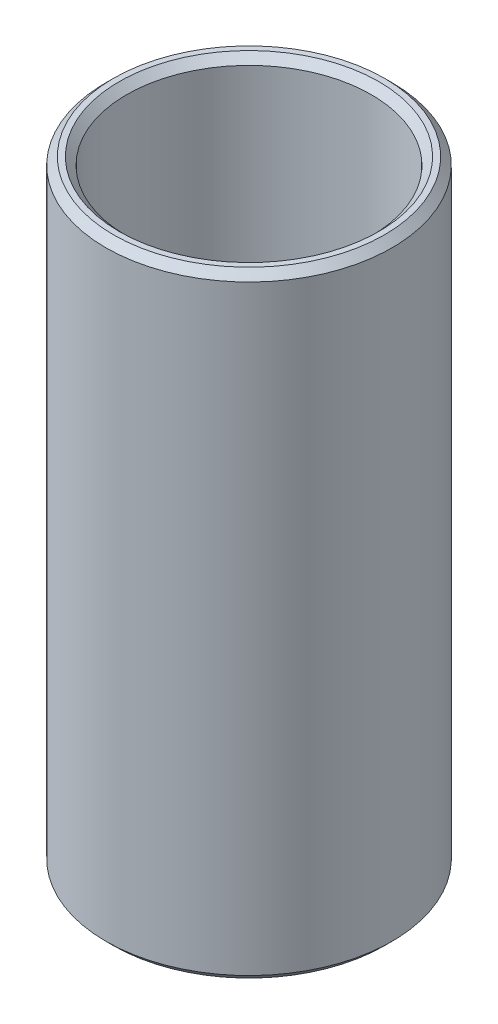
ISO-10303-21;
HEADER;
FILE_DESCRIPTION(('STEP AP214'),'2;1');
FILE_NAME('part.step','',(''),(''),'','','');
FILE_SCHEMA(('AUTOMOTIVE_DESIGN { 1 0 10303 214 1 1 1 1 }'));
ENDSEC;
DATA;
#1=APPLICATION_CONTEXT('core data for automotive mechanical design processes');
#2=APPLICATION_PROTOCOL_DEFINITION('international standard','automotive_design',2000,#1);
#3=PRODUCT_CONTEXT('',#1,'mechanical');
#4=PRODUCT('Part','Part','',(#3));
#5=PRODUCT_RELATED_PRODUCT_CATEGORY('part','',(#4));
#6=PRODUCT_DEFINITION_FORMATION('','',#4);
#7=PRODUCT_DEFINITION_CONTEXT('part definition',#1,'design');
#8=PRODUCT_DEFINITION('design','',#6,#7);
#9=PRODUCT_DEFINITION_SHAPE('','',#8);
#10=(LENGTH_UNIT() NAMED_UNIT(*) SI_UNIT(.MILLI.,.METRE.));
#11=(NAMED_UNIT(*) PLANE_ANGLE_UNIT() SI_UNIT($,.RADIAN.));
#12=(NAMED_UNIT(*) SI_UNIT($,.STERADIAN.) SOLID_ANGLE_UNIT());
#13=UNCERTAINTY_MEASURE_WITH_UNIT(LENGTH_MEASURE(1.E-05),#10,'distance_accuracy_value','');
#14=(GEOMETRIC_REPRESENTATION_CONTEXT(3) GLOBAL_UNCERTAINTY_ASSIGNED_CONTEXT((#13)) GLOBAL_UNIT_ASSIGNED_CONTEXT((#10,
#11,#12)) REPRESENTATION_CONTEXT('',''));
#15=CARTESIAN_POINT('',(0.,0.,0.));
#16=DIRECTION('',(0.,0.,1.));
#17=DIRECTION('',(1.,0.,0.));
#18=AXIS2_PLACEMENT_3D('',#15,#16,#17);
#19=CARTESIAN_POINT('',(0.,247.437087776184,0.));
#20=DIRECTION('',(0.,-1.,0.));
#21=DIRECTION('',(0.,0.,-1.));
#22=AXIS2_PLACEMENT_3D('',#19,#20,#21);
#23=CYLINDRICAL_SURFACE('',#22,57.5);
#24=CARTESIAN_POINT('',(0.,3.02072614342946,0.));
#25=DIRECTION('',(0.,1.,0.));
#26=DIRECTION('',(0.,0.,1.));
#27=AXIS2_PLACEMENT_3D('',#24,#25,#26);
#28=CIRCLE('',#27,57.5);
#29=CARTESIAN_POINT('',(0.,3.02072614342946,57.5));
#30=VERTEX_POINT('',#29);
#31=EDGE_CURVE('E10',#30,#30,#28,.T.);
#32=ORIENTED_EDGE('',*,*,#31,.T.);
#33=EDGE_LOOP('',(#32));
#34=FACE_BOUND('',#33,.T.);
#35=CARTESIAN_POINT('',(0.,244.416361632755,0.));
#36=DIRECTION('',(0.,1.,0.));
#37=DIRECTION('',(0.,0.,1.));
#38=AXIS2_PLACEMENT_3D('',#35,#36,#37);
#39=CIRCLE('',#38,57.5);
#40=CARTESIAN_POINT('',(0.,244.416361632755,57.5));
#41=VERTEX_POINT('',#40);
#42=EDGE_CURVE('E50',#41,#41,#39,.F.);
#43=ORIENTED_EDGE('',*,*,#42,.T.);
#44=EDGE_LOOP('',(#43));
#45=FACE_BOUND('',#44,.T.);
#46=ADVANCED_FACE('F39',(#34,#45),#23,.T.);
#47=CARTESIAN_POINT('',(0.,247.437087776184,0.));
#48=DIRECTION('',(0.,1.,0.));
#49=DIRECTION('',(0.,0.,1.));
#50=AXIS2_PLACEMENT_3D('',#47,#48,#49);
#51=PLANE('',#50);
#52=CARTESIAN_POINT('',(0.,247.437087776184,0.));
#53=DIRECTION('',(0.,1.,0.));
#54=DIRECTION('',(0.,0.,1.));
#55=AXIS2_PLACEMENT_3D('',#52,#53,#54);
#56=CIRCLE('',#55,52.1883546594288);
#57=CARTESIAN_POINT('',(0.,247.437087776184,52.1883546594288));
#58=VERTEX_POINT('',#57);
#59=EDGE_CURVE('E58',#58,#58,#56,.F.);
#60=ORIENTED_EDGE('',*,*,#59,.T.);
#61=EDGE_LOOP('',(#60));
#62=FACE_BOUND('',#61,.T.);
#63=CARTESIAN_POINT('',(0.,247.437087776184,0.));
#64=DIRECTION('',(0.,1.,0.));
#65=DIRECTION('',(0.,0.,1.));
#66=AXIS2_PLACEMENT_3D('',#63,#64,#65);
#67=CIRCLE('',#66,54.4792738565705);
#68=CARTESIAN_POINT('',(0.,247.437087776184,54.4792738565705));
#69=VERTEX_POINT('',#68);
#70=EDGE_CURVE('E61',#69,#69,#67,.T.);
#71=ORIENTED_EDGE('',*,*,#70,.T.);
#72=EDGE_LOOP('',(#71));
#73=FACE_BOUND('',#72,.T.);
#74=ADVANCED_FACE('F88',(#62,#73),#51,.T.);
#75=CARTESIAN_POINT('',(0.,0.,0.));
#76=DIRECTION('',(0.,1.,0.));
#77=DIRECTION('',(0.,0.,1.));
#78=AXIS2_PLACEMENT_3D('',#75,#76,#77);
#79=PLANE('',#78);
#80=CARTESIAN_POINT('',(0.,0.,0.));
#81=DIRECTION('',(0.,1.,0.));
#82=DIRECTION('',(0.,0.,1.));
#83=AXIS2_PLACEMENT_3D('',#80,#81,#82);
#84=CIRCLE('',#83,52.1883546594288);
#85=CARTESIAN_POINT('',(0.,0.,52.1883546594288));
#86=VERTEX_POINT('',#85);
#87=EDGE_CURVE('E51',#86,#86,#84,.T.);
#88=ORIENTED_EDGE('',*,*,#87,.T.);
#89=EDGE_LOOP('',(#88));
#90=FACE_BOUND('',#89,.T.);
#91=CARTESIAN_POINT('',(0.,0.,0.));
#92=DIRECTION('',(0.,1.,0.));
#93=DIRECTION('',(0.,0.,1.));
#94=AXIS2_PLACEMENT_3D('',#91,#92,#93);
#95=CIRCLE('',#94,54.4792738565705);
#96=CARTESIAN_POINT('',(0.,0.,54.4792738565705));
#97=VERTEX_POINT('',#96);
#98=EDGE_CURVE('E54',#97,#97,#95,.F.);
#99=ORIENTED_EDGE('',*,*,#98,.T.);
#100=EDGE_LOOP('',(#99));
#101=FACE_BOUND('',#100,.T.);
#102=ADVANCED_FACE('F83',(#90,#101),#79,.F.);
#103=CARTESIAN_POINT('',(0.,247.437087776184,0.));
#104=DIRECTION('',(0.,-1.,0.));
#105=DIRECTION('',(0.,0.,-1.));
#106=AXIS2_PLACEMENT_3D('',#103,#104,#105);
#107=CYLINDRICAL_SURFACE('',#106,49.1676285159993);
#108=CARTESIAN_POINT('',(0.,244.416361632755,0.));
#109=DIRECTION('',(0.,1.,0.));
#110=DIRECTION('',(0.,0.,1.));
#111=AXIS2_PLACEMENT_3D('',#108,#109,#110);
#112=CIRCLE('',#111,49.1676285159993);
#113=CARTESIAN_POINT('',(0.,244.416361632755,49.1676285159993));
#114=VERTEX_POINT('',#113);
#115=EDGE_CURVE('E67',#114,#114,#112,.T.);
#116=ORIENTED_EDGE('',*,*,#115,.T.);
#117=EDGE_LOOP('',(#116));
#118=FACE_BOUND('',#117,.T.);
#119=CARTESIAN_POINT('',(0.,3.02072614342955,0.));
#120=DIRECTION('',(0.,1.,0.));
#121=DIRECTION('',(0.,0.,1.));
#122=AXIS2_PLACEMENT_3D('',#119,#120,#121);
#123=CIRCLE('',#122,49.1676285159993);
#124=CARTESIAN_POINT('',(0.,3.02072614342955,49.1676285159993));
#125=VERTEX_POINT('',#124);
#126=EDGE_CURVE('E69',#125,#125,#123,.F.);
#127=ORIENTED_EDGE('',*,*,#126,.T.);
#128=EDGE_LOOP('',(#127));
#129=FACE_BOUND('',#128,.T.);
#130=ADVANCED_FACE('F71',(#118,#129),#107,.F.);
#131=CARTESIAN_POINT('',(0.,244.416361632755,0.));
#132=DIRECTION('',(0.,1.,0.));
#133=DIRECTION('',(0.,0.,1.));
#134=AXIS2_PLACEMENT_3D('',#131,#132,#133);
#135=CONICAL_SURFACE('',#134,49.1676285159993,0.785398163397446);
#136=ORIENTED_EDGE('',*,*,#59,.F.);
#137=EDGE_LOOP('',(#136));
#138=FACE_BOUND('',#137,.T.);
#139=ORIENTED_EDGE('',*,*,#115,.F.);
#140=EDGE_LOOP('',(#139));
#141=FACE_BOUND('',#140,.T.);
#142=ADVANCED_FACE('F77',(#138,#141),#135,.F.);
#143=CARTESIAN_POINT('',(0.,0.,0.));
#144=DIRECTION('',(0.,-1.,0.));
#145=DIRECTION('',(0.,0.,-1.));
#146=AXIS2_PLACEMENT_3D('',#143,#144,#145);
#147=CONICAL_SURFACE('',#146,52.1883546594288,0.785398163397438);
#148=ORIENTED_EDGE('',*,*,#126,.F.);
#149=EDGE_LOOP('',(#148));
#150=FACE_BOUND('',#149,.T.);
#151=ORIENTED_EDGE('',*,*,#87,.F.);
#152=EDGE_LOOP('',(#151));
#153=FACE_BOUND('',#152,.T.);
#154=ADVANCED_FACE('F73',(#150,#153),#147,.F.);
#155=CARTESIAN_POINT('',(0.,3.02072614342946,0.));
#156=DIRECTION('',(0.,1.,0.));
#157=DIRECTION('',(0.,0.,1.));
#158=AXIS2_PLACEMENT_3D('',#155,#156,#157);
#159=CONICAL_SURFACE('',#158,57.5,0.785398163397453);
#160=ORIENTED_EDGE('',*,*,#98,.F.);
#161=EDGE_LOOP('',(#160));
#162=FACE_BOUND('',#161,.T.);
#163=ORIENTED_EDGE('',*,*,#31,.F.);
#164=EDGE_LOOP('',(#163));
#165=FACE_BOUND('',#164,.T.);
#166=ADVANCED_FACE('F76',(#162,#165),#159,.T.);
#167=CARTESIAN_POINT('',(0.,247.437087776184,0.));
#168=DIRECTION('',(0.,-1.,0.));
#169=DIRECTION('',(0.,0.,-1.));
#170=AXIS2_PLACEMENT_3D('',#167,#168,#169);
#171=CONICAL_SURFACE('',#170,54.4792738565705,0.78539816339744);
#172=ORIENTED_EDGE('',*,*,#42,.F.);
#173=EDGE_LOOP('',(#172));
#174=FACE_BOUND('',#173,.T.);
#175=ORIENTED_EDGE('',*,*,#70,.F.);
#176=EDGE_LOOP('',(#175));
#177=FACE_BOUND('',#176,.T.);
#178=ADVANCED_FACE('F45',(#174,#177),#171,.T.);
#179=CLOSED_SHELL('',(#46,#74,#102,#130,#142,#154,#166,#178));
#180=MANIFOLD_SOLID_BREP('B2',#179);
#181=ADVANCED_BREP_SHAPE_REPRESENTATION('',(#18,#180),#14);
#182=SHAPE_DEFINITION_REPRESENTATION(#9,#181);
ENDSEC;
END-ISO-10303-21;
